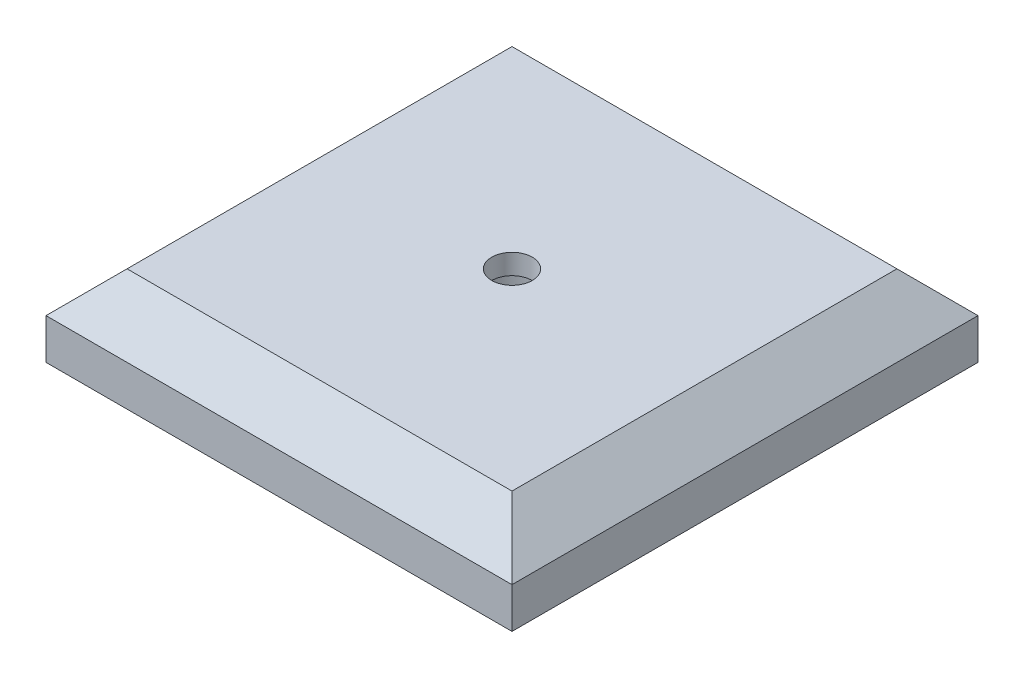
ISO-10303-21;
HEADER;
FILE_DESCRIPTION(('STEP AP214'),'2;1');
FILE_NAME('part.step','',(''),(''),'','','');
FILE_SCHEMA(('AUTOMOTIVE_DESIGN { 1 0 10303 214 1 1 1 1 }'));
ENDSEC;
DATA;
#1=APPLICATION_CONTEXT('core data for automotive mechanical design processes');
#2=APPLICATION_PROTOCOL_DEFINITION('international standard','automotive_design',2000,#1);
#3=PRODUCT_CONTEXT('',#1,'mechanical');
#4=PRODUCT('Part','Part','',(#3));
#5=PRODUCT_RELATED_PRODUCT_CATEGORY('part','',(#4));
#6=PRODUCT_DEFINITION_FORMATION('','',#4);
#7=PRODUCT_DEFINITION_CONTEXT('part definition',#1,'design');
#8=PRODUCT_DEFINITION('design','',#6,#7);
#9=PRODUCT_DEFINITION_SHAPE('','',#8);
#10=(LENGTH_UNIT() NAMED_UNIT(*) SI_UNIT(.MILLI.,.METRE.));
#11=(NAMED_UNIT(*) PLANE_ANGLE_UNIT() SI_UNIT($,.RADIAN.));
#12=(NAMED_UNIT(*) SI_UNIT($,.STERADIAN.) SOLID_ANGLE_UNIT());
#13=UNCERTAINTY_MEASURE_WITH_UNIT(LENGTH_MEASURE(1.E-05),#10,'distance_accuracy_value','');
#14=(GEOMETRIC_REPRESENTATION_CONTEXT(3) GLOBAL_UNCERTAINTY_ASSIGNED_CONTEXT((#13)) GLOBAL_UNIT_ASSIGNED_CONTEXT((#10,
#11,#12)) REPRESENTATION_CONTEXT('',''));
#15=CARTESIAN_POINT('',(0.,0.,0.));
#16=DIRECTION('',(0.,0.,1.));
#17=DIRECTION('',(1.,0.,0.));
#18=AXIS2_PLACEMENT_3D('',#15,#16,#17);
#19=CARTESIAN_POINT('',(36.5125,12.7,36.5125));
#20=DIRECTION('',(-1.,0.,0.));
#21=DIRECTION('',(0.,0.,1.));
#22=AXIS2_PLACEMENT_3D('',#19,#20,#21);
#23=PLANE('',#22);
#24=DIRECTION('',(0.,-1.,0.));
#25=VECTOR('',#24,1.);
#26=CARTESIAN_POINT('',(36.5125,12.7,-36.5125));
#27=LINE('',#26,#25);
#28=CARTESIAN_POINT('',(36.5125,6.34999999999998,-36.5125));
#29=VERTEX_POINT('',#28);
#30=CARTESIAN_POINT('',(36.5125,0.,-36.5125));
#31=VERTEX_POINT('',#30);
#32=EDGE_CURVE('E88',#29,#31,#27,.T.);
#33=ORIENTED_EDGE('',*,*,#32,.F.);
#34=DIRECTION('',(0.,0.,1.));
#35=VECTOR('',#34,1.);
#36=CARTESIAN_POINT('',(36.5125,6.34999999999998,36.5125));
#37=LINE('',#36,#35);
#38=CARTESIAN_POINT('',(36.5125,6.34999999999998,36.5125));
#39=VERTEX_POINT('',#38);
#40=EDGE_CURVE('E45',#29,#39,#37,.T.);
#41=ORIENTED_EDGE('',*,*,#40,.T.);
#42=DIRECTION('',(0.,-1.,0.));
#43=VECTOR('',#42,1.);
#44=CARTESIAN_POINT('',(36.5125,12.7,36.5125));
#45=LINE('',#44,#43);
#46=CARTESIAN_POINT('',(36.5125,0.,36.5125));
#47=VERTEX_POINT('',#46);
#48=EDGE_CURVE('E105',#39,#47,#45,.T.);
#49=ORIENTED_EDGE('',*,*,#48,.T.);
#50=DIRECTION('',(0.,0.,-1.));
#51=VECTOR('',#50,1.);
#52=CARTESIAN_POINT('',(36.5125,0.,36.5125));
#53=LINE('',#52,#51);
#54=EDGE_CURVE('E101',#47,#31,#53,.T.);
#55=ORIENTED_EDGE('',*,*,#54,.T.);
#56=EDGE_LOOP('',(#33,#41,#49,#55));
#57=FACE_BOUND('',#56,.T.);
#58=ADVANCED_FACE('F35',(#57),#23,.F.);
#59=CARTESIAN_POINT('',(-36.5125,12.7,-36.5125));
#60=DIRECTION('',(0.,0.,1.));
#61=DIRECTION('',(1.,0.,0.));
#62=AXIS2_PLACEMENT_3D('',#59,#60,#61);
#63=PLANE('',#62);
#64=DIRECTION('',(0.,-1.,0.));
#65=VECTOR('',#64,1.);
#66=CARTESIAN_POINT('',(-36.5125,12.7,-36.5125));
#67=LINE('',#66,#65);
#68=CARTESIAN_POINT('',(-36.5125,6.34999999999998,-36.5125));
#69=VERTEX_POINT('',#68);
#70=CARTESIAN_POINT('',(-36.5125,0.,-36.5125));
#71=VERTEX_POINT('',#70);
#72=EDGE_CURVE('E95',#69,#71,#67,.T.);
#73=ORIENTED_EDGE('',*,*,#72,.F.);
#74=DIRECTION('',(1.,0.,0.));
#75=VECTOR('',#74,1.);
#76=CARTESIAN_POINT('',(-36.5125,6.34999999999998,-36.5125));
#77=LINE('',#76,#75);
#78=EDGE_CURVE('E60',#69,#29,#77,.T.);
#79=ORIENTED_EDGE('',*,*,#78,.T.);
#80=ORIENTED_EDGE('',*,*,#32,.T.);
#81=DIRECTION('',(-1.,0.,0.));
#82=VECTOR('',#81,1.);
#83=CARTESIAN_POINT('',(-36.5125,0.,-36.5125));
#84=LINE('',#83,#82);
#85=EDGE_CURVE('E91',#31,#71,#84,.T.);
#86=ORIENTED_EDGE('',*,*,#85,.T.);
#87=EDGE_LOOP('',(#73,#79,#80,#86));
#88=FACE_BOUND('',#87,.T.);
#89=ADVANCED_FACE('F90',(#88),#63,.F.);
#90=CARTESIAN_POINT('',(-36.5125,12.7,36.5125));
#91=DIRECTION('',(1.,0.,0.));
#92=DIRECTION('',(0.,0.,-1.));
#93=AXIS2_PLACEMENT_3D('',#90,#91,#92);
#94=PLANE('',#93);
#95=DIRECTION('',(0.,-1.,0.));
#96=VECTOR('',#95,1.);
#97=CARTESIAN_POINT('',(-36.5125,12.7,36.5125));
#98=LINE('',#97,#96);
#99=CARTESIAN_POINT('',(-36.5125,6.34999999999998,36.5125));
#100=VERTEX_POINT('',#99);
#101=CARTESIAN_POINT('',(-36.5125,0.,36.5125));
#102=VERTEX_POINT('',#101);
#103=EDGE_CURVE('E118',#100,#102,#98,.T.);
#104=ORIENTED_EDGE('',*,*,#103,.F.);
#105=DIRECTION('',(0.,0.,-1.));
#106=VECTOR('',#105,1.);
#107=CARTESIAN_POINT('',(-36.5125,6.34999999999998,36.5125));
#108=LINE('',#107,#106);
#109=EDGE_CURVE('E129',#100,#69,#108,.T.);
#110=ORIENTED_EDGE('',*,*,#109,.T.);
#111=ORIENTED_EDGE('',*,*,#72,.T.);
#112=DIRECTION('',(0.,0.,1.));
#113=VECTOR('',#112,1.);
#114=CARTESIAN_POINT('',(-36.5125,0.,36.5125));
#115=LINE('',#114,#113);
#116=EDGE_CURVE('E103',#71,#102,#115,.T.);
#117=ORIENTED_EDGE('',*,*,#116,.T.);
#118=EDGE_LOOP('',(#104,#110,#111,#117));
#119=FACE_BOUND('',#118,.T.);
#120=ADVANCED_FACE('F177',(#119),#94,.F.);
#121=CARTESIAN_POINT('',(-36.5125,12.7,36.5125));
#122=DIRECTION('',(0.,0.,-1.));
#123=DIRECTION('',(-1.,0.,0.));
#124=AXIS2_PLACEMENT_3D('',#121,#122,#123);
#125=PLANE('',#124);
#126=ORIENTED_EDGE('',*,*,#48,.F.);
#127=DIRECTION('',(-1.,0.,0.));
#128=VECTOR('',#127,1.);
#129=CARTESIAN_POINT('',(-36.5125,6.34999999999998,36.5125));
#130=LINE('',#129,#128);
#131=EDGE_CURVE('E11',#39,#100,#130,.T.);
#132=ORIENTED_EDGE('',*,*,#131,.T.);
#133=ORIENTED_EDGE('',*,*,#103,.T.);
#134=DIRECTION('',(1.,0.,0.));
#135=VECTOR('',#134,1.);
#136=CARTESIAN_POINT('',(-36.5125,0.,36.5125));
#137=LINE('',#136,#135);
#138=EDGE_CURVE('E115',#102,#47,#137,.T.);
#139=ORIENTED_EDGE('',*,*,#138,.T.);
#140=EDGE_LOOP('',(#126,#132,#133,#139));
#141=FACE_BOUND('',#140,.T.);
#142=ADVANCED_FACE('F168',(#141),#125,.F.);
#143=CARTESIAN_POINT('',(0.,12.7,0.));
#144=DIRECTION('',(0.,-1.,0.));
#145=DIRECTION('',(0.,0.,-1.));
#146=AXIS2_PLACEMENT_3D('',#143,#144,#145);
#147=PLANE('',#146);
#148=DIRECTION('',(-1.,0.,0.));
#149=VECTOR('',#148,1.);
#150=CARTESIAN_POINT('',(0.,12.7,-30.1625));
#151=LINE('',#150,#149);
#152=CARTESIAN_POINT('',(30.1625,12.7,-30.1625));
#153=VERTEX_POINT('',#152);
#154=CARTESIAN_POINT('',(-30.1625,12.7,-30.1625));
#155=VERTEX_POINT('',#154);
#156=EDGE_CURVE('E124',#153,#155,#151,.T.);
#157=ORIENTED_EDGE('',*,*,#156,.T.);
#158=DIRECTION('',(0.,0.,1.));
#159=VECTOR('',#158,1.);
#160=CARTESIAN_POINT('',(-30.1625,12.7,0.));
#161=LINE('',#160,#159);
#162=CARTESIAN_POINT('',(-30.1625,12.7,30.1625));
#163=VERTEX_POINT('',#162);
#164=EDGE_CURVE('E126',#155,#163,#161,.T.);
#165=ORIENTED_EDGE('',*,*,#164,.T.);
#166=DIRECTION('',(1.,0.,0.));
#167=VECTOR('',#166,1.);
#168=CARTESIAN_POINT('',(0.,12.7,30.1625));
#169=LINE('',#168,#167);
#170=CARTESIAN_POINT('',(30.1625,12.7,30.1625));
#171=VERTEX_POINT('',#170);
#172=EDGE_CURVE('E94',#163,#171,#169,.T.);
#173=ORIENTED_EDGE('',*,*,#172,.T.);
#174=DIRECTION('',(0.,0.,-1.));
#175=VECTOR('',#174,1.);
#176=CARTESIAN_POINT('',(30.1625,12.7,0.));
#177=LINE('',#176,#175);
#178=EDGE_CURVE('E122',#171,#153,#177,.T.);
#179=ORIENTED_EDGE('',*,*,#178,.T.);
#180=EDGE_LOOP('',(#157,#165,#173,#179));
#181=FACE_BOUND('',#180,.T.);
#182=CARTESIAN_POINT('',(0.,12.7,0.));
#183=DIRECTION('',(0.,1.,0.));
#184=DIRECTION('',(0.,0.,1.));
#185=AXIS2_PLACEMENT_3D('',#182,#183,#184);
#186=CIRCLE('',#185,3.175);
#187=CARTESIAN_POINT('',(0.,12.7,3.175));
#188=VERTEX_POINT('',#187);
#189=EDGE_CURVE('E107',#188,#188,#186,.T.);
#190=ORIENTED_EDGE('',*,*,#189,.F.);
#191=EDGE_LOOP('',(#190));
#192=FACE_BOUND('',#191,.T.);
#193=ADVANCED_FACE('F166',(#181,#192),#147,.F.);
#194=CARTESIAN_POINT('',(0.,0.,0.));
#195=DIRECTION('',(0.,-1.,0.));
#196=DIRECTION('',(0.,0.,-1.));
#197=AXIS2_PLACEMENT_3D('',#194,#195,#196);
#198=PLANE('',#197);
#199=CARTESIAN_POINT('',(0.,0.,0.));
#200=DIRECTION('',(0.,-1.,0.));
#201=DIRECTION('',(0.,0.,-1.));
#202=AXIS2_PLACEMENT_3D('',#199,#200,#201);
#203=CIRCLE('',#202,6.35);
#204=CARTESIAN_POINT('',(0.,0.,-6.35));
#205=VERTEX_POINT('',#204);
#206=EDGE_CURVE('E144',#205,#205,#203,.T.);
#207=ORIENTED_EDGE('',*,*,#206,.F.);
#208=EDGE_LOOP('',(#207));
#209=FACE_BOUND('',#208,.T.);
#210=ORIENTED_EDGE('',*,*,#54,.F.);
#211=ORIENTED_EDGE('',*,*,#138,.F.);
#212=ORIENTED_EDGE('',*,*,#116,.F.);
#213=ORIENTED_EDGE('',*,*,#85,.F.);
#214=EDGE_LOOP('',(#210,#211,#212,#213));
#215=FACE_BOUND('',#214,.T.);
#216=ADVANCED_FACE('F99',(#209,#215),#198,.T.);
#217=CARTESIAN_POINT('',(0.,9.525,0.));
#218=DIRECTION('',(0.,1.,0.));
#219=DIRECTION('',(0.,0.,1.));
#220=AXIS2_PLACEMENT_3D('',#217,#218,#219);
#221=CYLINDRICAL_SURFACE('',#220,3.175);
#222=CARTESIAN_POINT('',(0.,9.525,0.));
#223=DIRECTION('',(0.,1.,0.));
#224=DIRECTION('',(0.,0.,1.));
#225=AXIS2_PLACEMENT_3D('',#222,#223,#224);
#226=CIRCLE('',#225,3.175);
#227=CARTESIAN_POINT('',(0.,9.525,3.175));
#228=VERTEX_POINT('',#227);
#229=EDGE_CURVE('E110',#228,#228,#226,.T.);
#230=ORIENTED_EDGE('',*,*,#229,.F.);
#231=EDGE_LOOP('',(#230));
#232=FACE_BOUND('',#231,.T.);
#233=ORIENTED_EDGE('',*,*,#189,.T.);
#234=EDGE_LOOP('',(#233));
#235=FACE_BOUND('',#234,.T.);
#236=ADVANCED_FACE('F160',(#232,#235),#221,.F.);
#237=CARTESIAN_POINT('',(0.,9.525,0.));
#238=DIRECTION('',(0.,-1.,0.));
#239=DIRECTION('',(0.,0.,-1.));
#240=AXIS2_PLACEMENT_3D('',#237,#238,#239);
#241=PLANE('',#240);
#242=CARTESIAN_POINT('',(0.,9.525,0.));
#243=DIRECTION('',(0.,-1.,0.));
#244=DIRECTION('',(0.,0.,-1.));
#245=AXIS2_PLACEMENT_3D('',#242,#243,#244);
#246=CIRCLE('',#245,6.35);
#247=CARTESIAN_POINT('',(0.,9.525,-6.35));
#248=VERTEX_POINT('',#247);
#249=EDGE_CURVE('E149',#248,#248,#246,.T.);
#250=ORIENTED_EDGE('',*,*,#249,.T.);
#251=EDGE_LOOP('',(#250));
#252=FACE_BOUND('',#251,.T.);
#253=ORIENTED_EDGE('',*,*,#229,.T.);
#254=EDGE_LOOP('',(#253));
#255=FACE_BOUND('',#254,.T.);
#256=ADVANCED_FACE('F158',(#252,#255),#241,.T.);
#257=CARTESIAN_POINT('',(0.,9.525,0.));
#258=DIRECTION('',(0.,-1.,0.));
#259=DIRECTION('',(0.,0.,-1.));
#260=AXIS2_PLACEMENT_3D('',#257,#258,#259);
#261=CYLINDRICAL_SURFACE('',#260,6.35);
#262=ORIENTED_EDGE('',*,*,#249,.F.);
#263=EDGE_LOOP('',(#262));
#264=FACE_BOUND('',#263,.T.);
#265=ORIENTED_EDGE('',*,*,#206,.T.);
#266=EDGE_LOOP('',(#265));
#267=FACE_BOUND('',#266,.T.);
#268=ADVANCED_FACE('F208',(#264,#267),#261,.F.);
#269=CARTESIAN_POINT('',(30.1625,12.7,0.));
#270=DIRECTION('',(-0.707106781186548,-0.707106781186547,0.));
#271=DIRECTION('',(0.,0.,-1.));
#272=AXIS2_PLACEMENT_3D('',#269,#270,#271);
#273=PLANE('',#272);
#274=DIRECTION('',(-0.577350269189625,0.577350269189627,-0.577350269189625));
#275=VECTOR('',#274,1.);
#276=CARTESIAN_POINT('',(20.1083333333333,22.7541666666667,20.1083333333333));
#277=LINE('',#276,#275);
#278=EDGE_CURVE('E137',#39,#171,#277,.T.);
#279=ORIENTED_EDGE('',*,*,#278,.F.);
#280=ORIENTED_EDGE('',*,*,#40,.F.);
#281=DIRECTION('',(-0.577350269189625,0.577350269189627,0.577350269189625));
#282=VECTOR('',#281,1.);
#283=CARTESIAN_POINT('',(20.1083333333333,22.7541666666667,-20.1083333333333));
#284=LINE('',#283,#282);
#285=EDGE_CURVE('E40',#153,#29,#284,.F.);
#286=ORIENTED_EDGE('',*,*,#285,.F.);
#287=ORIENTED_EDGE('',*,*,#178,.F.);
#288=EDGE_LOOP('',(#279,#280,#286,#287));
#289=FACE_BOUND('',#288,.T.);
#290=ADVANCED_FACE('F38',(#289),#273,.F.);
#291=CARTESIAN_POINT('',(0.,12.7,-30.1625));
#292=DIRECTION('',(0.,-0.707106781186547,0.707106781186548));
#293=DIRECTION('',(-1.,0.,0.));
#294=AXIS2_PLACEMENT_3D('',#291,#292,#293);
#295=PLANE('',#294);
#296=ORIENTED_EDGE('',*,*,#285,.T.);
#297=ORIENTED_EDGE('',*,*,#78,.F.);
#298=DIRECTION('',(0.577350269189625,0.577350269189627,0.577350269189625));
#299=VECTOR('',#298,1.);
#300=CARTESIAN_POINT('',(-20.1083333333333,22.7541666666667,-20.1083333333333));
#301=LINE('',#300,#299);
#302=EDGE_CURVE('E136',#155,#69,#301,.F.);
#303=ORIENTED_EDGE('',*,*,#302,.F.);
#304=ORIENTED_EDGE('',*,*,#156,.F.);
#305=EDGE_LOOP('',(#296,#297,#303,#304));
#306=FACE_BOUND('',#305,.T.);
#307=ADVANCED_FACE('F201',(#306),#295,.F.);
#308=CARTESIAN_POINT('',(0.,12.7,30.1625));
#309=DIRECTION('',(0.,-0.707106781186547,-0.707106781186548));
#310=DIRECTION('',(1.,0.,0.));
#311=AXIS2_PLACEMENT_3D('',#308,#309,#310);
#312=PLANE('',#311);
#313=ORIENTED_EDGE('',*,*,#278,.T.);
#314=ORIENTED_EDGE('',*,*,#172,.F.);
#315=DIRECTION('',(-0.577350269189625,-0.577350269189627,0.577350269189625));
#316=VECTOR('',#315,1.);
#317=CARTESIAN_POINT('',(-20.1083333333333,22.7541666666667,20.1083333333333));
#318=LINE('',#317,#316);
#319=EDGE_CURVE('E134',#100,#163,#318,.F.);
#320=ORIENTED_EDGE('',*,*,#319,.F.);
#321=ORIENTED_EDGE('',*,*,#131,.F.);
#322=EDGE_LOOP('',(#313,#314,#320,#321));
#323=FACE_BOUND('',#322,.T.);
#324=ADVANCED_FACE('F195',(#323),#312,.F.);
#325=CARTESIAN_POINT('',(-30.1625,12.7,0.));
#326=DIRECTION('',(0.707106781186548,-0.707106781186547,0.));
#327=DIRECTION('',(0.,0.,1.));
#328=AXIS2_PLACEMENT_3D('',#325,#326,#327);
#329=PLANE('',#328);
#330=ORIENTED_EDGE('',*,*,#302,.T.);
#331=ORIENTED_EDGE('',*,*,#109,.F.);
#332=ORIENTED_EDGE('',*,*,#319,.T.);
#333=ORIENTED_EDGE('',*,*,#164,.F.);
#334=EDGE_LOOP('',(#330,#331,#332,#333));
#335=FACE_BOUND('',#334,.T.);
#336=ADVANCED_FACE('F189',(#335),#329,.F.);
#337=CLOSED_SHELL('',(#58,#89,#120,#142,#193,#216,#236,#256,#268,#290,#307,#324,#336));
#338=MANIFOLD_SOLID_BREP('B2',#337);
#339=ADVANCED_BREP_SHAPE_REPRESENTATION('',(#18,#338),#14);
#340=SHAPE_DEFINITION_REPRESENTATION(#9,#339);
ENDSEC;
END-ISO-10303-21;
